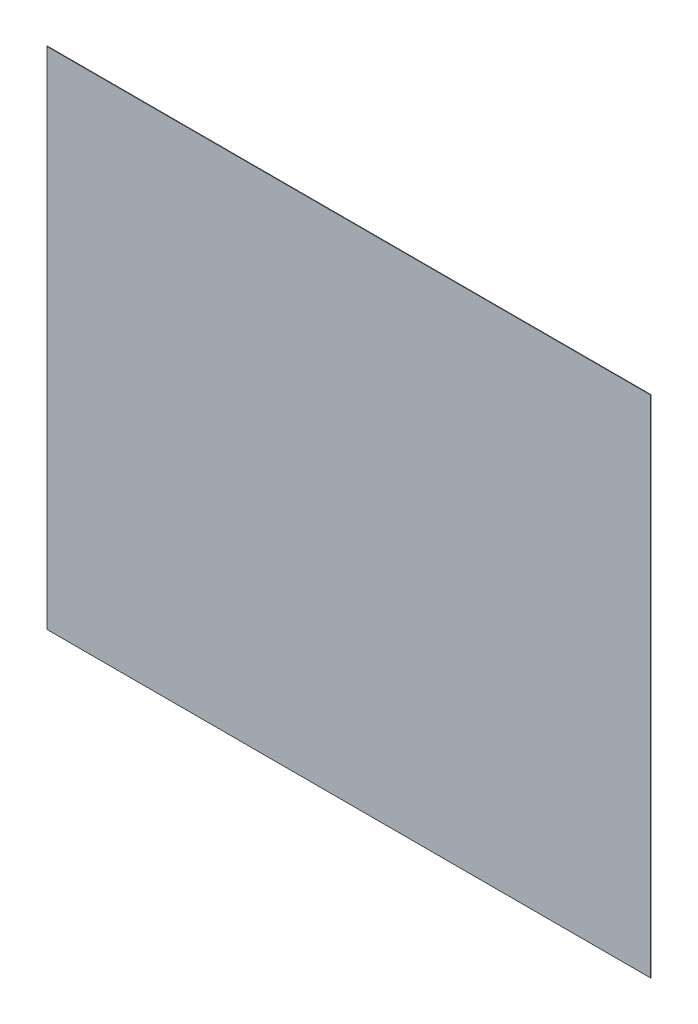
ISO-10303-21;
HEADER;
FILE_DESCRIPTION(('STEP AP214'),'2;1');
FILE_NAME('part.step','',(''),(''),'','','');
FILE_SCHEMA(('AUTOMOTIVE_DESIGN { 1 0 10303 214 1 1 1 1 }'));
ENDSEC;
DATA;
#1=APPLICATION_CONTEXT('core data for automotive mechanical design processes');
#2=APPLICATION_PROTOCOL_DEFINITION('international standard','automotive_design',2000,#1);
#3=PRODUCT_CONTEXT('',#1,'mechanical');
#4=PRODUCT('Part','Part','',(#3));
#5=PRODUCT_RELATED_PRODUCT_CATEGORY('part','',(#4));
#6=PRODUCT_DEFINITION_FORMATION('','',#4);
#7=PRODUCT_DEFINITION_CONTEXT('part definition',#1,'design');
#8=PRODUCT_DEFINITION('design','',#6,#7);
#9=PRODUCT_DEFINITION_SHAPE('','',#8);
#10=(LENGTH_UNIT() NAMED_UNIT(*) SI_UNIT(.MILLI.,.METRE.));
#11=(NAMED_UNIT(*) PLANE_ANGLE_UNIT() SI_UNIT($,.RADIAN.));
#12=(NAMED_UNIT(*) SI_UNIT($,.STERADIAN.) SOLID_ANGLE_UNIT());
#13=UNCERTAINTY_MEASURE_WITH_UNIT(LENGTH_MEASURE(1.E-05),#10,'distance_accuracy_value','');
#14=(GEOMETRIC_REPRESENTATION_CONTEXT(3) GLOBAL_UNCERTAINTY_ASSIGNED_CONTEXT((#13)) GLOBAL_UNIT_ASSIGNED_CONTEXT((#10,
#11,#12)) REPRESENTATION_CONTEXT('',''));
#15=CARTESIAN_POINT('',(0.,0.,0.));
#16=DIRECTION('',(0.,0.,1.));
#17=DIRECTION('',(1.,0.,0.));
#18=AXIS2_PLACEMENT_3D('',#15,#16,#17);
#19=CARTESIAN_POINT('',(-2.628178783895E-05,-4.825610938634E-05,0.00100076));
#20=DIRECTION('',(0.,0.,1.));
#21=DIRECTION('',(1.,0.,0.));
#22=AXIS2_PLACEMENT_3D('',#19,#20,#21);
#23=PLANE('',#22);
#24=DIRECTION('',(0.,1.,0.));
#25=VECTOR('',#24,1.);
#26=CARTESIAN_POINT('',(0.5986272,-0.50065178,0.00100076));
#27=LINE('',#26,#25);
#28=CARTESIAN_POINT('',(0.5986272,-0.50065178,0.00100076));
#29=VERTEX_POINT('',#28);
#30=CARTESIAN_POINT('',(0.5986272,0.50045874,0.00100076));
#31=VERTEX_POINT('',#30);
#32=EDGE_CURVE('E90',#29,#31,#27,.T.);
#33=ORIENTED_EDGE('',*,*,#32,.T.);
#34=DIRECTION('',(-0.999999987001545,0.000161235571559627,0.));
#35=VECTOR('',#34,1.);
#36=CARTESIAN_POINT('',(0.5986272,0.50045874,0.00100076));
#37=LINE('',#36,#35);
#38=CARTESIAN_POINT('',(-0.5986272,0.50065178,0.00100076));
#39=VERTEX_POINT('',#38);
#40=EDGE_CURVE('E85',#31,#39,#37,.T.);
#41=ORIENTED_EDGE('',*,*,#40,.T.);
#42=DIRECTION('',(0.,-1.,0.));
#43=VECTOR('',#42,1.);
#44=CARTESIAN_POINT('',(-0.5986272,0.50065178,0.00100076));
#45=LINE('',#44,#43);
#46=CARTESIAN_POINT('',(-0.5986272,-0.50065178,0.00100076));
#47=VERTEX_POINT('',#46);
#48=EDGE_CURVE('E102',#39,#47,#45,.T.);
#49=ORIENTED_EDGE('',*,*,#48,.T.);
#50=DIRECTION('',(1.,0.,0.));
#51=VECTOR('',#50,1.);
#52=CARTESIAN_POINT('',(-0.5986272,-0.50065178,0.00100076));
#53=LINE('',#52,#51);
#54=EDGE_CURVE('E11',#47,#29,#53,.T.);
#55=ORIENTED_EDGE('',*,*,#54,.T.);
#56=EDGE_LOOP('',(#33,#41,#49,#55));
#57=FACE_BOUND('',#56,.T.);
#58=ADVANCED_FACE('F17',(#57),#23,.T.);
#59=CARTESIAN_POINT('',(-2.628178783895E-05,-4.825610938634E-05,0.));
#60=DIRECTION('',(0.,0.,1.));
#61=DIRECTION('',(1.,0.,0.));
#62=AXIS2_PLACEMENT_3D('',#59,#60,#61);
#63=PLANE('',#62);
#64=DIRECTION('',(1.,0.,0.));
#65=VECTOR('',#64,1.);
#66=CARTESIAN_POINT('',(-0.5986272,-0.50065178,0.));
#67=LINE('',#66,#65);
#68=CARTESIAN_POINT('',(-0.5986272,-0.50065178,0.));
#69=VERTEX_POINT('',#68);
#70=CARTESIAN_POINT('',(0.5986272,-0.50065178,0.));
#71=VERTEX_POINT('',#70);
#72=EDGE_CURVE('E26',#69,#71,#67,.T.);
#73=ORIENTED_EDGE('',*,*,#72,.F.);
#74=DIRECTION('',(0.,-1.,0.));
#75=VECTOR('',#74,1.);
#76=CARTESIAN_POINT('',(-0.5986272,0.50065178,0.));
#77=LINE('',#76,#75);
#78=CARTESIAN_POINT('',(-0.5986272,0.50065178,0.));
#79=VERTEX_POINT('',#78);
#80=EDGE_CURVE('E73',#79,#69,#77,.T.);
#81=ORIENTED_EDGE('',*,*,#80,.F.);
#82=DIRECTION('',(-0.999999987001545,0.000161235571559627,0.));
#83=VECTOR('',#82,1.);
#84=CARTESIAN_POINT('',(0.5986272,0.50045874,0.));
#85=LINE('',#84,#83);
#86=CARTESIAN_POINT('',(0.5986272,0.50045874,0.));
#87=VERTEX_POINT('',#86);
#88=EDGE_CURVE('E68',#87,#79,#85,.T.);
#89=ORIENTED_EDGE('',*,*,#88,.F.);
#90=DIRECTION('',(0.,1.,0.));
#91=VECTOR('',#90,1.);
#92=CARTESIAN_POINT('',(0.5986272,-0.50065178,0.));
#93=LINE('',#92,#91);
#94=EDGE_CURVE('E71',#71,#87,#93,.T.);
#95=ORIENTED_EDGE('',*,*,#94,.F.);
#96=EDGE_LOOP('',(#73,#81,#89,#95));
#97=FACE_BOUND('',#96,.T.);
#98=ADVANCED_FACE('F19',(#97),#63,.F.);
#99=CARTESIAN_POINT('',(-0.5986272,-0.50065178,0.));
#100=DIRECTION('',(0.,1.,0.));
#101=DIRECTION('',(1.,0.,0.));
#102=AXIS2_PLACEMENT_3D('',#99,#100,#101);
#103=PLANE('',#102);
#104=ORIENTED_EDGE('',*,*,#72,.T.);
#105=DIRECTION('',(0.,0.,1.));
#106=VECTOR('',#105,1.);
#107=CARTESIAN_POINT('',(0.5986272,-0.50065178,0.));
#108=LINE('',#107,#106);
#109=EDGE_CURVE('E79',#71,#29,#108,.T.);
#110=ORIENTED_EDGE('',*,*,#109,.T.);
#111=ORIENTED_EDGE('',*,*,#54,.F.);
#112=DIRECTION('',(0.,0.,1.));
#113=VECTOR('',#112,1.);
#114=CARTESIAN_POINT('',(-0.5986272,-0.50065178,0.));
#115=LINE('',#114,#113);
#116=EDGE_CURVE('E105',#69,#47,#115,.T.);
#117=ORIENTED_EDGE('',*,*,#116,.F.);
#118=EDGE_LOOP('',(#104,#110,#111,#117));
#119=FACE_BOUND('',#118,.T.);
#120=ADVANCED_FACE('F116',(#119),#103,.F.);
#121=CARTESIAN_POINT('',(-0.5986272,0.50065178,0.));
#122=DIRECTION('',(1.,0.,0.));
#123=DIRECTION('',(0.,1.,0.));
#124=AXIS2_PLACEMENT_3D('',#121,#122,#123);
#125=PLANE('',#124);
#126=ORIENTED_EDGE('',*,*,#80,.T.);
#127=ORIENTED_EDGE('',*,*,#116,.T.);
#128=ORIENTED_EDGE('',*,*,#48,.F.);
#129=DIRECTION('',(0.,0.,1.));
#130=VECTOR('',#129,1.);
#131=CARTESIAN_POINT('',(-0.5986272,0.50065178,0.));
#132=LINE('',#131,#130);
#133=EDGE_CURVE('E78',#79,#39,#132,.T.);
#134=ORIENTED_EDGE('',*,*,#133,.F.);
#135=EDGE_LOOP('',(#126,#127,#128,#134));
#136=FACE_BOUND('',#135,.T.);
#137=ADVANCED_FACE('F118',(#136),#125,.F.);
#138=CARTESIAN_POINT('',(0.5986272,0.50045874,0.));
#139=DIRECTION('',(-0.000161235571559627,-0.999999987001545,0.));
#140=DIRECTION('',(-0.999999987001545,0.000161235571559627,0.));
#141=AXIS2_PLACEMENT_3D('',#138,#139,#140);
#142=PLANE('',#141);
#143=ORIENTED_EDGE('',*,*,#88,.T.);
#144=ORIENTED_EDGE('',*,*,#133,.T.);
#145=ORIENTED_EDGE('',*,*,#40,.F.);
#146=DIRECTION('',(0.,0.,1.));
#147=VECTOR('',#146,1.);
#148=CARTESIAN_POINT('',(0.5986272,0.50045874,0.));
#149=LINE('',#148,#147);
#150=EDGE_CURVE('E82',#87,#31,#149,.T.);
#151=ORIENTED_EDGE('',*,*,#150,.F.);
#152=EDGE_LOOP('',(#143,#144,#145,#151));
#153=FACE_BOUND('',#152,.T.);
#154=ADVANCED_FACE('F83',(#153),#142,.F.);
#155=CARTESIAN_POINT('',(0.5986272,-0.50065178,0.));
#156=DIRECTION('',(-1.,0.,0.));
#157=DIRECTION('',(0.,0.,1.));
#158=AXIS2_PLACEMENT_3D('',#155,#156,#157);
#159=PLANE('',#158);
#160=ORIENTED_EDGE('',*,*,#94,.T.);
#161=ORIENTED_EDGE('',*,*,#150,.T.);
#162=ORIENTED_EDGE('',*,*,#32,.F.);
#163=ORIENTED_EDGE('',*,*,#109,.F.);
#164=EDGE_LOOP('',(#160,#161,#162,#163));
#165=FACE_BOUND('',#164,.T.);
#166=ADVANCED_FACE('F93',(#165),#159,.F.);
#167=CLOSED_SHELL('',(#58,#98,#120,#137,#154,#166));
#168=MANIFOLD_SOLID_BREP('B1',#167);
#169=ADVANCED_BREP_SHAPE_REPRESENTATION('',(#18,#168),#14);
#170=SHAPE_DEFINITION_REPRESENTATION(#9,#169);
ENDSEC;
END-ISO-10303-21;
